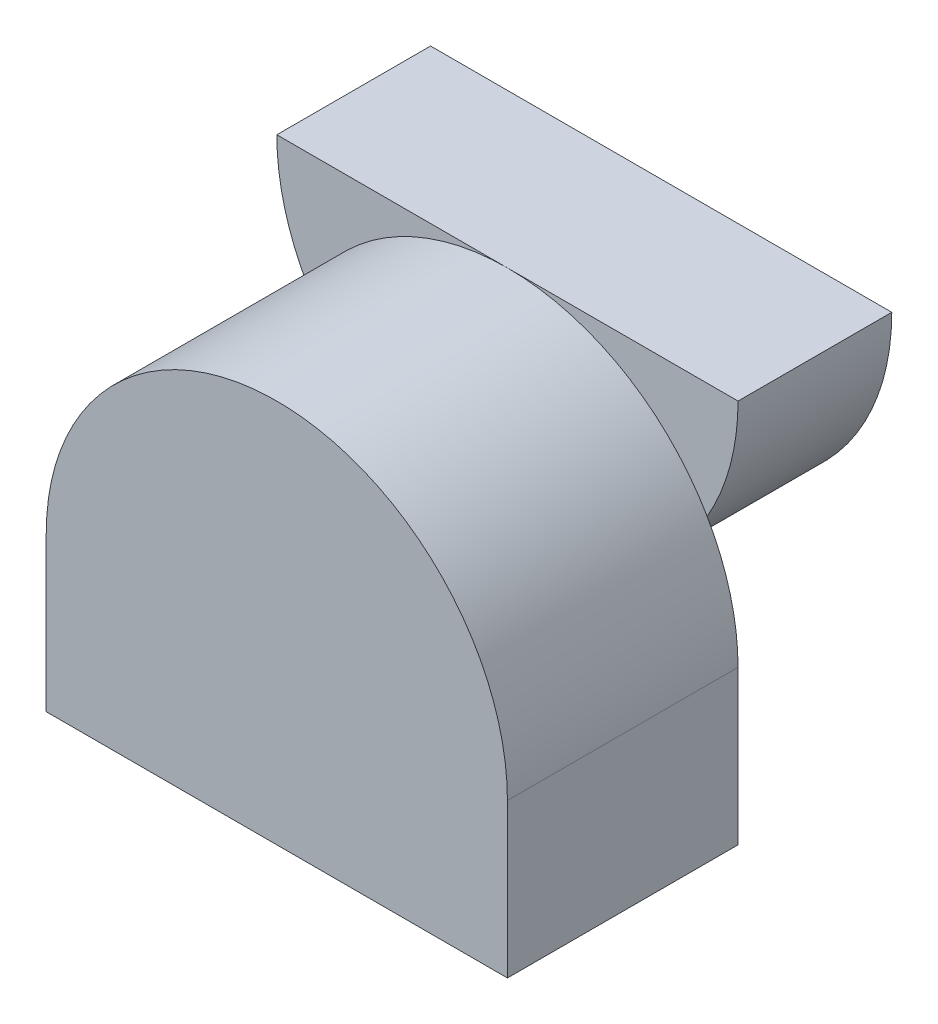
ISO-10303-21;
HEADER;
FILE_DESCRIPTION(('STEP AP214'),'2;1');
FILE_NAME('part.step','',(''),(''),'','','');
FILE_SCHEMA(('AUTOMOTIVE_DESIGN { 1 0 10303 214 1 1 1 1 }'));
ENDSEC;
DATA;
#1=APPLICATION_CONTEXT('core data for automotive mechanical design processes');
#2=APPLICATION_PROTOCOL_DEFINITION('international standard','automotive_design',2000,#1);
#3=PRODUCT_CONTEXT('',#1,'mechanical');
#4=PRODUCT('Part','Part','',(#3));
#5=PRODUCT_RELATED_PRODUCT_CATEGORY('part','',(#4));
#6=PRODUCT_DEFINITION_FORMATION('','',#4);
#7=PRODUCT_DEFINITION_CONTEXT('part definition',#1,'design');
#8=PRODUCT_DEFINITION('design','',#6,#7);
#9=PRODUCT_DEFINITION_SHAPE('','',#8);
#10=(LENGTH_UNIT() NAMED_UNIT(*) SI_UNIT(.MILLI.,.METRE.));
#11=(NAMED_UNIT(*) PLANE_ANGLE_UNIT() SI_UNIT($,.RADIAN.));
#12=(NAMED_UNIT(*) SI_UNIT($,.STERADIAN.) SOLID_ANGLE_UNIT());
#13=UNCERTAINTY_MEASURE_WITH_UNIT(LENGTH_MEASURE(1.E-05),#10,'distance_accuracy_value','');
#14=(GEOMETRIC_REPRESENTATION_CONTEXT(3) GLOBAL_UNCERTAINTY_ASSIGNED_CONTEXT((#13)) GLOBAL_UNIT_ASSIGNED_CONTEXT((#10,
#11,#12)) REPRESENTATION_CONTEXT('',''));
#15=CARTESIAN_POINT('',(0.,0.,0.));
#16=DIRECTION('',(0.,0.,1.));
#17=DIRECTION('',(1.,0.,0.));
#18=AXIS2_PLACEMENT_3D('',#15,#16,#17);
#19=CARTESIAN_POINT('',(-15.,10.,0.));
#20=DIRECTION('',(0.,0.,1.));
#21=DIRECTION('',(1.,0.,0.));
#22=AXIS2_PLACEMENT_3D('',#19,#20,#21);
#23=PLANE('',#22);
#24=CARTESIAN_POINT('',(-15.,25.,0.));
#25=DIRECTION('',(0.,0.,-1.));
#26=DIRECTION('',(1.,0.,0.));
#27=AXIS2_PLACEMENT_3D('',#24,#25,#26);
#28=CIRCLE('',#27,15.);
#29=CARTESIAN_POINT('',(-2.00961894323342,17.5,0.));
#30=VERTEX_POINT('',#29);
#31=CARTESIAN_POINT('',(-27.9903810567666,17.5,0.));
#32=VERTEX_POINT('',#31);
#33=EDGE_CURVE('E11',#30,#32,#28,.T.);
#34=ORIENTED_EDGE('',*,*,#33,.F.);
#35=CARTESIAN_POINT('',(-15.,10.,0.));
#36=DIRECTION('',(0.,0.,1.));
#37=DIRECTION('',(1.,0.,0.));
#38=AXIS2_PLACEMENT_3D('',#35,#36,#37);
#39=CIRCLE('',#38,15.);
#40=CARTESIAN_POINT('',(0.,10.,0.));
#41=VERTEX_POINT('',#40);
#42=EDGE_CURVE('E122',#41,#30,#39,.T.);
#43=ORIENTED_EDGE('',*,*,#42,.F.);
#44=DIRECTION('',(0.,1.,0.));
#45=VECTOR('',#44,1.);
#46=CARTESIAN_POINT('',(0.,0.,0.));
#47=LINE('',#46,#45);
#48=CARTESIAN_POINT('',(0.,0.,0.));
#49=VERTEX_POINT('',#48);
#50=EDGE_CURVE('E130',#49,#41,#47,.T.);
#51=ORIENTED_EDGE('',*,*,#50,.F.);
#52=DIRECTION('',(1.,0.,0.));
#53=VECTOR('',#52,1.);
#54=CARTESIAN_POINT('',(-30.,0.,0.));
#55=LINE('',#54,#53);
#56=CARTESIAN_POINT('',(-30.,0.,0.));
#57=VERTEX_POINT('',#56);
#58=EDGE_CURVE('E139',#57,#49,#55,.T.);
#59=ORIENTED_EDGE('',*,*,#58,.F.);
#60=DIRECTION('',(0.,-1.,0.));
#61=VECTOR('',#60,1.);
#62=CARTESIAN_POINT('',(-30.,10.,0.));
#63=LINE('',#62,#61);
#64=CARTESIAN_POINT('',(-30.,10.,0.));
#65=VERTEX_POINT('',#64);
#66=EDGE_CURVE('E137',#65,#57,#63,.T.);
#67=ORIENTED_EDGE('',*,*,#66,.F.);
#68=EDGE_CURVE('E118',#32,#65,#39,.T.);
#69=ORIENTED_EDGE('',*,*,#68,.F.);
#70=EDGE_LOOP('',(#34,#43,#51,#59,#67,#69));
#71=FACE_BOUND('',#70,.T.);
#72=ADVANCED_FACE('F33',(#71),#23,.F.);
#73=CARTESIAN_POINT('',(-15.,10.,15.));
#74=DIRECTION('',(0.,0.,-1.));
#75=DIRECTION('',(-1.,0.,0.));
#76=AXIS2_PLACEMENT_3D('',#73,#74,#75);
#77=CYLINDRICAL_SURFACE('',#76,15.);
#78=ORIENTED_EDGE('',*,*,#42,.T.);
#79=CARTESIAN_POINT('',(-15.,25.,0.));
#80=VERTEX_POINT('',#79);
#81=EDGE_CURVE('E51',#30,#80,#39,.T.);
#82=ORIENTED_EDGE('',*,*,#81,.T.);
#83=EDGE_CURVE('E120',#80,#32,#39,.T.);
#84=ORIENTED_EDGE('',*,*,#83,.T.);
#85=ORIENTED_EDGE('',*,*,#68,.T.);
#86=DIRECTION('',(0.,0.,-1.));
#87=VECTOR('',#86,1.);
#88=CARTESIAN_POINT('',(-30.,10.,15.));
#89=LINE('',#88,#87);
#90=CARTESIAN_POINT('',(-30.,10.,15.));
#91=VERTEX_POINT('',#90);
#92=EDGE_CURVE('E37',#91,#65,#89,.T.);
#93=ORIENTED_EDGE('',*,*,#92,.F.);
#94=CARTESIAN_POINT('',(-15.,10.,15.));
#95=DIRECTION('',(0.,0.,1.));
#96=DIRECTION('',(1.,0.,0.));
#97=AXIS2_PLACEMENT_3D('',#94,#95,#96);
#98=CIRCLE('',#97,15.);
#99=CARTESIAN_POINT('',(0.,10.,15.));
#100=VERTEX_POINT('',#99);
#101=EDGE_CURVE('E126',#100,#91,#98,.T.);
#102=ORIENTED_EDGE('',*,*,#101,.F.);
#103=DIRECTION('',(0.,0.,-1.));
#104=VECTOR('',#103,1.);
#105=CARTESIAN_POINT('',(0.,10.,15.));
#106=LINE('',#105,#104);
#107=EDGE_CURVE('E135',#100,#41,#106,.T.);
#108=ORIENTED_EDGE('',*,*,#107,.T.);
#109=EDGE_LOOP('',(#78,#82,#84,#85,#93,#102,#108));
#110=FACE_BOUND('',#109,.T.);
#111=ADVANCED_FACE('F35',(#110),#77,.T.);
#112=CARTESIAN_POINT('',(-30.,10.,15.));
#113=DIRECTION('',(1.,0.,0.));
#114=DIRECTION('',(0.,0.,-1.));
#115=AXIS2_PLACEMENT_3D('',#112,#113,#114);
#116=PLANE('',#115);
#117=ORIENTED_EDGE('',*,*,#66,.T.);
#118=DIRECTION('',(0.,0.,-1.));
#119=VECTOR('',#118,1.);
#120=CARTESIAN_POINT('',(-30.,0.,15.));
#121=LINE('',#120,#119);
#122=CARTESIAN_POINT('',(-30.,0.,15.));
#123=VERTEX_POINT('',#122);
#124=EDGE_CURVE('E146',#123,#57,#121,.T.);
#125=ORIENTED_EDGE('',*,*,#124,.F.);
#126=DIRECTION('',(0.,-1.,0.));
#127=VECTOR('',#126,1.);
#128=CARTESIAN_POINT('',(-30.,10.,15.));
#129=LINE('',#128,#127);
#130=EDGE_CURVE('E129',#91,#123,#129,.T.);
#131=ORIENTED_EDGE('',*,*,#130,.F.);
#132=ORIENTED_EDGE('',*,*,#92,.T.);
#133=EDGE_LOOP('',(#117,#125,#131,#132));
#134=FACE_BOUND('',#133,.T.);
#135=ADVANCED_FACE('F155',(#134),#116,.F.);
#136=CARTESIAN_POINT('',(-30.,0.,15.));
#137=DIRECTION('',(0.,1.,0.));
#138=DIRECTION('',(0.,0.,1.));
#139=AXIS2_PLACEMENT_3D('',#136,#137,#138);
#140=PLANE('',#139);
#141=ORIENTED_EDGE('',*,*,#58,.T.);
#142=DIRECTION('',(0.,0.,-1.));
#143=VECTOR('',#142,1.);
#144=CARTESIAN_POINT('',(0.,0.,15.));
#145=LINE('',#144,#143);
#146=CARTESIAN_POINT('',(0.,0.,15.));
#147=VERTEX_POINT('',#146);
#148=EDGE_CURVE('E144',#147,#49,#145,.T.);
#149=ORIENTED_EDGE('',*,*,#148,.F.);
#150=DIRECTION('',(1.,0.,0.));
#151=VECTOR('',#150,1.);
#152=CARTESIAN_POINT('',(-30.,0.,15.));
#153=LINE('',#152,#151);
#154=EDGE_CURVE('E132',#123,#147,#153,.T.);
#155=ORIENTED_EDGE('',*,*,#154,.F.);
#156=ORIENTED_EDGE('',*,*,#124,.T.);
#157=EDGE_LOOP('',(#141,#149,#155,#156));
#158=FACE_BOUND('',#157,.T.);
#159=ADVANCED_FACE('F160',(#158),#140,.F.);
#160=CARTESIAN_POINT('',(0.,0.,15.));
#161=DIRECTION('',(-1.,0.,0.));
#162=DIRECTION('',(0.,0.,1.));
#163=AXIS2_PLACEMENT_3D('',#160,#161,#162);
#164=PLANE('',#163);
#165=ORIENTED_EDGE('',*,*,#50,.T.);
#166=ORIENTED_EDGE('',*,*,#107,.F.);
#167=DIRECTION('',(0.,1.,0.));
#168=VECTOR('',#167,1.);
#169=CARTESIAN_POINT('',(0.,0.,15.));
#170=LINE('',#169,#168);
#171=EDGE_CURVE('E134',#147,#100,#170,.T.);
#172=ORIENTED_EDGE('',*,*,#171,.F.);
#173=ORIENTED_EDGE('',*,*,#148,.T.);
#174=EDGE_LOOP('',(#165,#166,#172,#173));
#175=FACE_BOUND('',#174,.T.);
#176=ADVANCED_FACE('F163',(#175),#164,.F.);
#177=CARTESIAN_POINT('',(-15.,10.,15.));
#178=DIRECTION('',(0.,0.,1.));
#179=DIRECTION('',(1.,0.,0.));
#180=AXIS2_PLACEMENT_3D('',#177,#178,#179);
#181=PLANE('',#180);
#182=ORIENTED_EDGE('',*,*,#101,.T.);
#183=ORIENTED_EDGE('',*,*,#130,.T.);
#184=ORIENTED_EDGE('',*,*,#154,.T.);
#185=ORIENTED_EDGE('',*,*,#171,.T.);
#186=EDGE_LOOP('',(#182,#183,#184,#185));
#187=FACE_BOUND('',#186,.T.);
#188=ADVANCED_FACE('F166',(#187),#181,.T.);
#189=CARTESIAN_POINT('',(-15.,25.,0.));
#190=DIRECTION('',(0.,0.,1.));
#191=DIRECTION('',(1.,0.,0.));
#192=AXIS2_PLACEMENT_3D('',#189,#190,#191);
#193=PLANE('',#192);
#194=ORIENTED_EDGE('',*,*,#81,.F.);
#195=CARTESIAN_POINT('',(0.,25.,0.));
#196=VERTEX_POINT('',#195);
#197=EDGE_CURVE('E43',#196,#30,#28,.T.);
#198=ORIENTED_EDGE('',*,*,#197,.F.);
#199=DIRECTION('',(1.,0.,0.));
#200=VECTOR('',#199,1.);
#201=CARTESIAN_POINT('',(0.,25.,0.));
#202=LINE('',#201,#200);
#203=EDGE_CURVE('E254',#80,#196,#202,.T.);
#204=ORIENTED_EDGE('',*,*,#203,.F.);
#205=EDGE_LOOP('',(#194,#198,#204));
#206=FACE_BOUND('',#205,.T.);
#207=ADVANCED_FACE('F168',(#206),#193,.T.);
#208=ORIENTED_EDGE('',*,*,#83,.F.);
#209=CARTESIAN_POINT('',(-30.,25.,0.));
#210=VERTEX_POINT('',#209);
#211=EDGE_CURVE('E112',#210,#80,#202,.T.);
#212=ORIENTED_EDGE('',*,*,#211,.F.);
#213=EDGE_CURVE('E44',#32,#210,#28,.T.);
#214=ORIENTED_EDGE('',*,*,#213,.F.);
#215=EDGE_LOOP('',(#208,#212,#214));
#216=FACE_BOUND('',#215,.T.);
#217=ADVANCED_FACE('F174',(#216),#193,.T.);
#218=CARTESIAN_POINT('',(-15.,25.,-10.));
#219=DIRECTION('',(0.,0.,1.));
#220=DIRECTION('',(1.,0.,0.));
#221=AXIS2_PLACEMENT_3D('',#218,#219,#220);
#222=CYLINDRICAL_SURFACE('',#221,15.);
#223=ORIENTED_EDGE('',*,*,#197,.T.);
#224=ORIENTED_EDGE('',*,*,#33,.T.);
#225=ORIENTED_EDGE('',*,*,#213,.T.);
#226=DIRECTION('',(0.,0.,1.));
#227=VECTOR('',#226,1.);
#228=CARTESIAN_POINT('',(-30.,25.,-10.));
#229=LINE('',#228,#227);
#230=CARTESIAN_POINT('',(-30.,25.,-10.));
#231=VERTEX_POINT('',#230);
#232=EDGE_CURVE('E103',#231,#210,#229,.T.);
#233=ORIENTED_EDGE('',*,*,#232,.F.);
#234=CARTESIAN_POINT('',(-15.,25.,-10.));
#235=DIRECTION('',(0.,0.,-1.));
#236=DIRECTION('',(1.,0.,0.));
#237=AXIS2_PLACEMENT_3D('',#234,#235,#236);
#238=CIRCLE('',#237,15.);
#239=CARTESIAN_POINT('',(0.,25.,-10.));
#240=VERTEX_POINT('',#239);
#241=EDGE_CURVE('E108',#240,#231,#238,.T.);
#242=ORIENTED_EDGE('',*,*,#241,.F.);
#243=DIRECTION('',(0.,0.,1.));
#244=VECTOR('',#243,1.);
#245=CARTESIAN_POINT('',(0.,25.,-10.));
#246=LINE('',#245,#244);
#247=EDGE_CURVE('E105',#240,#196,#246,.T.);
#248=ORIENTED_EDGE('',*,*,#247,.T.);
#249=EDGE_LOOP('',(#223,#224,#225,#233,#242,#248));
#250=FACE_BOUND('',#249,.T.);
#251=ADVANCED_FACE('F115',(#250),#222,.T.);
#252=CARTESIAN_POINT('',(0.,25.,-10.));
#253=DIRECTION('',(0.,-1.,0.));
#254=DIRECTION('',(0.,0.,-1.));
#255=AXIS2_PLACEMENT_3D('',#252,#253,#254);
#256=PLANE('',#255);
#257=ORIENTED_EDGE('',*,*,#211,.T.);
#258=ORIENTED_EDGE('',*,*,#203,.T.);
#259=ORIENTED_EDGE('',*,*,#247,.F.);
#260=DIRECTION('',(1.,0.,0.));
#261=VECTOR('',#260,1.);
#262=CARTESIAN_POINT('',(0.,25.,-10.));
#263=LINE('',#262,#261);
#264=EDGE_CURVE('E98',#231,#240,#263,.T.);
#265=ORIENTED_EDGE('',*,*,#264,.F.);
#266=ORIENTED_EDGE('',*,*,#232,.T.);
#267=EDGE_LOOP('',(#257,#258,#259,#265,#266));
#268=FACE_BOUND('',#267,.T.);
#269=ADVANCED_FACE('F101',(#268),#256,.F.);
#270=CARTESIAN_POINT('',(-15.,25.,-10.));
#271=DIRECTION('',(0.,0.,1.));
#272=DIRECTION('',(1.,0.,0.));
#273=AXIS2_PLACEMENT_3D('',#270,#271,#272);
#274=PLANE('',#273);
#275=ORIENTED_EDGE('',*,*,#241,.T.);
#276=ORIENTED_EDGE('',*,*,#264,.T.);
#277=EDGE_LOOP('',(#275,#276));
#278=FACE_BOUND('',#277,.T.);
#279=ADVANCED_FACE('F110',(#278),#274,.F.);
#280=CLOSED_SHELL('',(#72,#111,#135,#159,#176,#188,#207,#217,#251,#269,#279));
#281=MANIFOLD_SOLID_BREP('B2',#280);
#282=ADVANCED_BREP_SHAPE_REPRESENTATION('',(#18,#281),#14);
#283=SHAPE_DEFINITION_REPRESENTATION(#9,#282);
ENDSEC;
END-ISO-10303-21;
